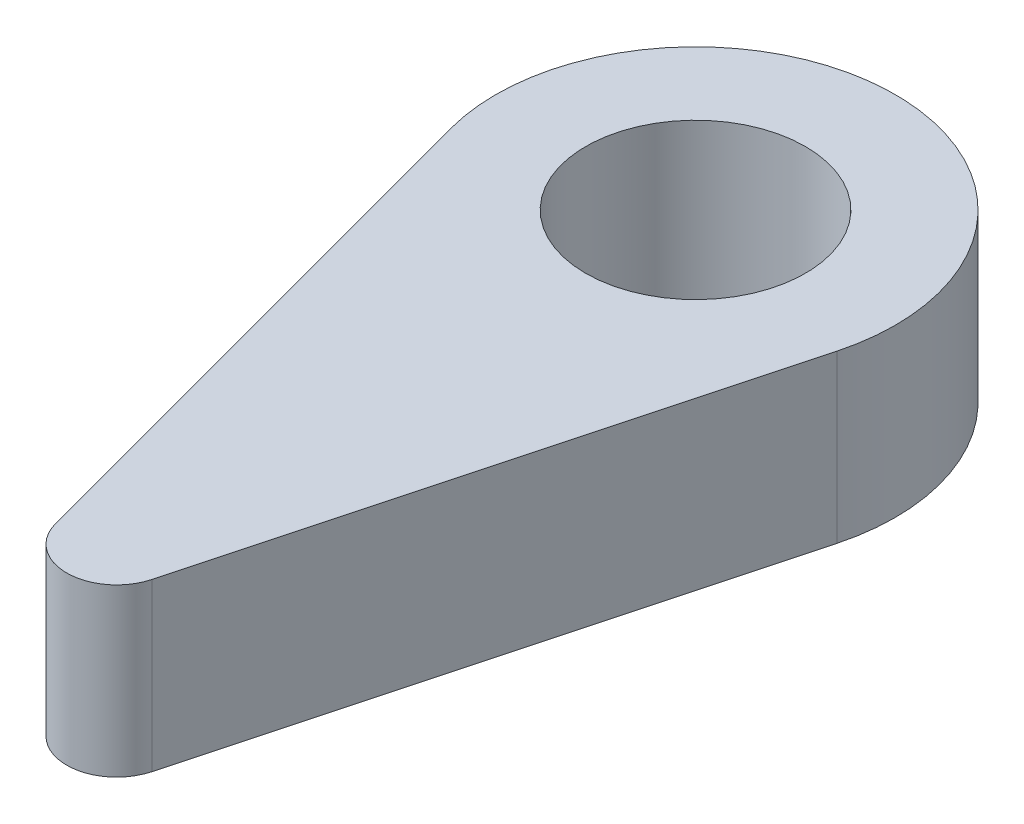
ISO-10303-21;
HEADER;
FILE_DESCRIPTION(('STEP AP214'),'2;1');
FILE_NAME('part.step','',(''),(''),'','','');
FILE_SCHEMA(('AUTOMOTIVE_DESIGN { 1 0 10303 214 1 1 1 1 }'));
ENDSEC;
DATA;
#1=APPLICATION_CONTEXT('core data for automotive mechanical design processes');
#2=APPLICATION_PROTOCOL_DEFINITION('international standard','automotive_design',2000,#1);
#3=PRODUCT_CONTEXT('',#1,'mechanical');
#4=PRODUCT('Part','Part','',(#3));
#5=PRODUCT_RELATED_PRODUCT_CATEGORY('part','',(#4));
#6=PRODUCT_DEFINITION_FORMATION('','',#4);
#7=PRODUCT_DEFINITION_CONTEXT('part definition',#1,'design');
#8=PRODUCT_DEFINITION('design','',#6,#7);
#9=PRODUCT_DEFINITION_SHAPE('','',#8);
#10=(LENGTH_UNIT() NAMED_UNIT(*) SI_UNIT(.MILLI.,.METRE.));
#11=(NAMED_UNIT(*) PLANE_ANGLE_UNIT() SI_UNIT($,.RADIAN.));
#12=(NAMED_UNIT(*) SI_UNIT($,.STERADIAN.) SOLID_ANGLE_UNIT());
#13=UNCERTAINTY_MEASURE_WITH_UNIT(LENGTH_MEASURE(1.E-05),#10,'distance_accuracy_value','');
#14=(GEOMETRIC_REPRESENTATION_CONTEXT(3) GLOBAL_UNCERTAINTY_ASSIGNED_CONTEXT((#13)) GLOBAL_UNIT_ASSIGNED_CONTEXT((#10,
#11,#12)) REPRESENTATION_CONTEXT('',''));
#15=CARTESIAN_POINT('',(0.,0.,0.));
#16=DIRECTION('',(0.,0.,1.));
#17=DIRECTION('',(1.,0.,0.));
#18=AXIS2_PLACEMENT_3D('',#15,#16,#17);
#19=CARTESIAN_POINT('',(5.79555495773441,5.,1.55291427061513));
#20=DIRECTION('',(-0.965925826289068,0.,-0.258819045102522));
#21=DIRECTION('',(-0.258819045102522,0.,0.965925826289068));
#22=AXIS2_PLACEMENT_3D('',#19,#20,#21);
#23=PLANE('',#22);
#24=DIRECTION('',(0.258819045102522,0.,-0.965925826289068));
#25=VECTOR('',#24,1.);
#26=CARTESIAN_POINT('',(5.79555495773441,0.,1.55291427061513));
#27=LINE('',#26,#25);
#28=CARTESIAN_POINT('',(1.4488887394336,0.,17.774893440857));
#29=VERTEX_POINT('',#28);
#30=CARTESIAN_POINT('',(5.79555495773441,0.,1.55291427061513));
#31=VERTEX_POINT('',#30);
#32=EDGE_CURVE('E101',#29,#31,#27,.T.);
#33=ORIENTED_EDGE('',*,*,#32,.T.);
#34=DIRECTION('',(0.,-1.,0.));
#35=VECTOR('',#34,1.);
#36=CARTESIAN_POINT('',(5.79555495773441,5.,1.55291427061513));
#37=LINE('',#36,#35);
#38=CARTESIAN_POINT('',(5.79555495773441,5.,1.55291427061513));
#39=VERTEX_POINT('',#38);
#40=EDGE_CURVE('E11',#39,#31,#37,.T.);
#41=ORIENTED_EDGE('',*,*,#40,.F.);
#42=DIRECTION('',(0.258819045102522,0.,-0.965925826289068));
#43=VECTOR('',#42,1.);
#44=CARTESIAN_POINT('',(5.79555495773441,5.,1.55291427061513));
#45=LINE('',#44,#43);
#46=CARTESIAN_POINT('',(1.4488887394336,5.,17.774893440857));
#47=VERTEX_POINT('',#46);
#48=EDGE_CURVE('E83',#47,#39,#45,.T.);
#49=ORIENTED_EDGE('',*,*,#48,.F.);
#50=DIRECTION('',(0.,-1.,0.));
#51=VECTOR('',#50,1.);
#52=CARTESIAN_POINT('',(1.4488887394336,5.,17.774893440857));
#53=LINE('',#52,#51);
#54=EDGE_CURVE('E100',#47,#29,#53,.T.);
#55=ORIENTED_EDGE('',*,*,#54,.T.);
#56=EDGE_LOOP('',(#33,#41,#49,#55));
#57=FACE_BOUND('',#56,.T.);
#58=ADVANCED_FACE('F35',(#57),#23,.F.);
#59=CARTESIAN_POINT('',(0.,5.,0.));
#60=DIRECTION('',(0.,-1.,0.));
#61=DIRECTION('',(0.,0.,-1.));
#62=AXIS2_PLACEMENT_3D('',#59,#60,#61);
#63=CYLINDRICAL_SURFACE('',#62,6.);
#64=CARTESIAN_POINT('',(0.,0.,0.));
#65=DIRECTION('',(0.,1.,0.));
#66=DIRECTION('',(0.,0.,1.));
#67=AXIS2_PLACEMENT_3D('',#64,#65,#66);
#68=CIRCLE('',#67,6.);
#69=CARTESIAN_POINT('',(-5.79555495773441,0.,1.55291427061513));
#70=VERTEX_POINT('',#69);
#71=EDGE_CURVE('E88',#31,#70,#68,.T.);
#72=ORIENTED_EDGE('',*,*,#71,.T.);
#73=DIRECTION('',(0.,-1.,0.));
#74=VECTOR('',#73,1.);
#75=CARTESIAN_POINT('',(-5.79555495773441,5.,1.55291427061513));
#76=LINE('',#75,#74);
#77=CARTESIAN_POINT('',(-5.79555495773441,5.,1.55291427061513));
#78=VERTEX_POINT('',#77);
#79=EDGE_CURVE('E43',#78,#70,#76,.T.);
#80=ORIENTED_EDGE('',*,*,#79,.F.);
#81=CARTESIAN_POINT('',(0.,5.,0.));
#82=DIRECTION('',(0.,1.,0.));
#83=DIRECTION('',(0.,0.,1.));
#84=AXIS2_PLACEMENT_3D('',#81,#82,#83);
#85=CIRCLE('',#84,6.);
#86=EDGE_CURVE('E77',#39,#78,#85,.T.);
#87=ORIENTED_EDGE('',*,*,#86,.F.);
#88=ORIENTED_EDGE('',*,*,#40,.T.);
#89=EDGE_LOOP('',(#72,#80,#87,#88));
#90=FACE_BOUND('',#89,.T.);
#91=ADVANCED_FACE('F87',(#90),#63,.T.);
#92=CARTESIAN_POINT('',(-5.79555495773441,5.,1.55291427061513));
#93=DIRECTION('',(-0.965925826289068,0.,0.258819045102522));
#94=DIRECTION('',(0.258819045102522,0.,0.965925826289068));
#95=AXIS2_PLACEMENT_3D('',#92,#93,#94);
#96=PLANE('',#95);
#97=DIRECTION('',(-0.258819045102522,0.,-0.965925826289068));
#98=VECTOR('',#97,1.);
#99=CARTESIAN_POINT('',(-5.79555495773441,0.,1.55291427061513));
#100=LINE('',#99,#98);
#101=CARTESIAN_POINT('',(-1.4488887394336,0.,17.774893440857));
#102=VERTEX_POINT('',#101);
#103=EDGE_CURVE('E105',#102,#70,#100,.T.);
#104=ORIENTED_EDGE('',*,*,#103,.F.);
#105=DIRECTION('',(0.,-1.,0.));
#106=VECTOR('',#105,1.);
#107=CARTESIAN_POINT('',(-1.4488887394336,5.,17.774893440857));
#108=LINE('',#107,#106);
#109=CARTESIAN_POINT('',(-1.4488887394336,5.,17.774893440857));
#110=VERTEX_POINT('',#109);
#111=EDGE_CURVE('E67',#110,#102,#108,.T.);
#112=ORIENTED_EDGE('',*,*,#111,.F.);
#113=DIRECTION('',(-0.258819045102522,0.,-0.965925826289068));
#114=VECTOR('',#113,1.);
#115=CARTESIAN_POINT('',(-5.79555495773441,5.,1.55291427061513));
#116=LINE('',#115,#114);
#117=EDGE_CURVE('E81',#110,#78,#116,.T.);
#118=ORIENTED_EDGE('',*,*,#117,.T.);
#119=ORIENTED_EDGE('',*,*,#79,.T.);
#120=EDGE_LOOP('',(#104,#112,#118,#119));
#121=FACE_BOUND('',#120,.T.);
#122=ADVANCED_FACE('F92',(#121),#96,.T.);
#123=CARTESIAN_POINT('',(0.,5.,17.3866648732032));
#124=DIRECTION('',(0.,-1.,0.));
#125=DIRECTION('',(0.,0.,-1.));
#126=AXIS2_PLACEMENT_3D('',#123,#124,#125);
#127=CYLINDRICAL_SURFACE('',#126,1.5);
#128=CARTESIAN_POINT('',(0.,0.,17.3866648732032));
#129=DIRECTION('',(0.,1.,0.));
#130=DIRECTION('',(0.,0.,1.));
#131=AXIS2_PLACEMENT_3D('',#128,#129,#130);
#132=CIRCLE('',#131,1.5);
#133=EDGE_CURVE('E70',#102,#29,#132,.T.);
#134=ORIENTED_EDGE('',*,*,#133,.T.);
#135=ORIENTED_EDGE('',*,*,#54,.F.);
#136=CARTESIAN_POINT('',(0.,5.,17.3866648732032));
#137=DIRECTION('',(0.,1.,0.));
#138=DIRECTION('',(0.,0.,1.));
#139=AXIS2_PLACEMENT_3D('',#136,#137,#138);
#140=CIRCLE('',#139,1.5);
#141=EDGE_CURVE('E51',#110,#47,#140,.T.);
#142=ORIENTED_EDGE('',*,*,#141,.F.);
#143=ORIENTED_EDGE('',*,*,#111,.T.);
#144=EDGE_LOOP('',(#134,#135,#142,#143));
#145=FACE_BOUND('',#144,.T.);
#146=ADVANCED_FACE('F123',(#145),#127,.T.);
#147=CARTESIAN_POINT('',(0.,5.,0.));
#148=DIRECTION('',(0.,-1.,0.));
#149=DIRECTION('',(0.,0.,-1.));
#150=AXIS2_PLACEMENT_3D('',#147,#148,#149);
#151=CYLINDRICAL_SURFACE('',#150,3.3);
#152=CARTESIAN_POINT('',(0.,5.,0.));
#153=DIRECTION('',(0.,1.,0.));
#154=DIRECTION('',(0.,0.,1.));
#155=AXIS2_PLACEMENT_3D('',#152,#153,#154);
#156=CIRCLE('',#155,3.3);
#157=CARTESIAN_POINT('',(0.,5.,3.3));
#158=VERTEX_POINT('',#157);
#159=EDGE_CURVE('E94',#158,#158,#156,.T.);
#160=ORIENTED_EDGE('',*,*,#159,.T.);
#161=EDGE_LOOP('',(#160));
#162=FACE_BOUND('',#161,.T.);
#163=CARTESIAN_POINT('',(0.,0.,0.));
#164=DIRECTION('',(0.,1.,0.));
#165=DIRECTION('',(0.,0.,1.));
#166=AXIS2_PLACEMENT_3D('',#163,#164,#165);
#167=CIRCLE('',#166,3.3);
#168=CARTESIAN_POINT('',(0.,0.,3.3));
#169=VERTEX_POINT('',#168);
#170=EDGE_CURVE('E108',#169,#169,#167,.T.);
#171=ORIENTED_EDGE('',*,*,#170,.F.);
#172=EDGE_LOOP('',(#171));
#173=FACE_BOUND('',#172,.T.);
#174=ADVANCED_FACE('F121',(#162,#173),#151,.F.);
#175=CARTESIAN_POINT('',(0.,5.,0.));
#176=DIRECTION('',(0.,1.,0.));
#177=DIRECTION('',(0.,0.,1.));
#178=AXIS2_PLACEMENT_3D('',#175,#176,#177);
#179=PLANE('',#178);
#180=ORIENTED_EDGE('',*,*,#48,.T.);
#181=ORIENTED_EDGE('',*,*,#86,.T.);
#182=ORIENTED_EDGE('',*,*,#117,.F.);
#183=ORIENTED_EDGE('',*,*,#141,.T.);
#184=EDGE_LOOP('',(#180,#181,#182,#183));
#185=FACE_BOUND('',#184,.T.);
#186=ORIENTED_EDGE('',*,*,#159,.F.);
#187=EDGE_LOOP('',(#186));
#188=FACE_BOUND('',#187,.T.);
#189=ADVANCED_FACE('F78',(#185,#188),#179,.T.);
#190=CARTESIAN_POINT('',(0.,0.,0.));
#191=DIRECTION('',(0.,1.,0.));
#192=DIRECTION('',(0.,0.,1.));
#193=AXIS2_PLACEMENT_3D('',#190,#191,#192);
#194=PLANE('',#193);
#195=ORIENTED_EDGE('',*,*,#32,.F.);
#196=ORIENTED_EDGE('',*,*,#133,.F.);
#197=ORIENTED_EDGE('',*,*,#103,.T.);
#198=ORIENTED_EDGE('',*,*,#71,.F.);
#199=EDGE_LOOP('',(#195,#196,#197,#198));
#200=FACE_BOUND('',#199,.T.);
#201=ORIENTED_EDGE('',*,*,#170,.T.);
#202=EDGE_LOOP('',(#201));
#203=FACE_BOUND('',#202,.T.);
#204=ADVANCED_FACE('F115',(#200,#203),#194,.F.);
#205=CLOSED_SHELL('',(#58,#91,#122,#146,#174,#189,#204));
#206=MANIFOLD_SOLID_BREP('B2',#205);
#207=ADVANCED_BREP_SHAPE_REPRESENTATION('',(#18,#206),#14);
#208=SHAPE_DEFINITION_REPRESENTATION(#9,#207);
ENDSEC;
END-ISO-10303-21;
